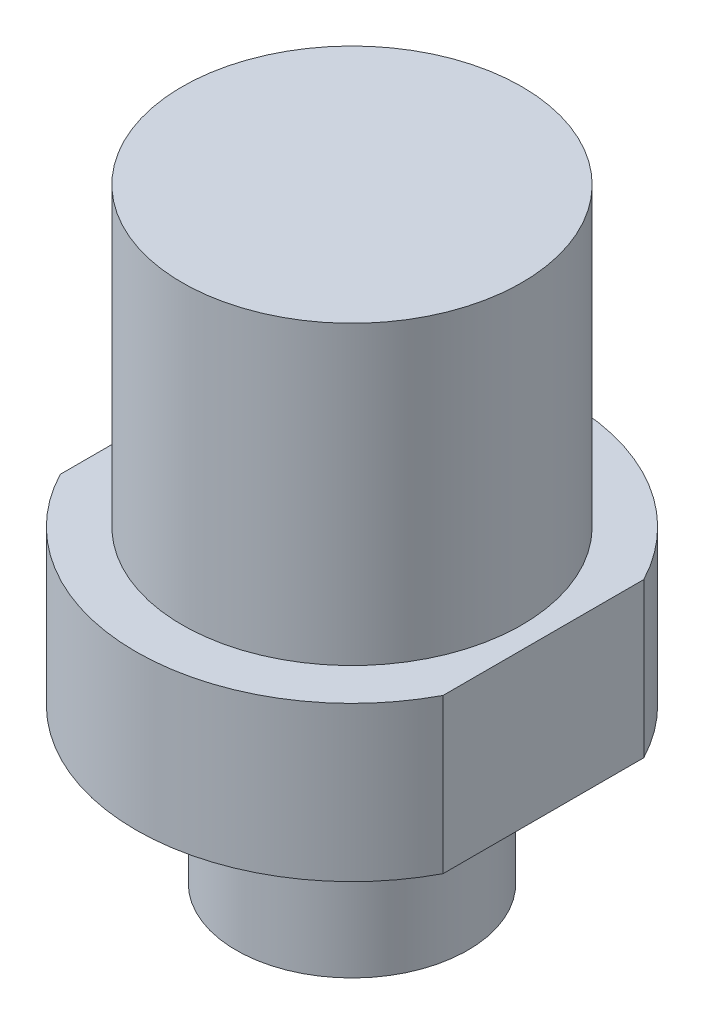
ISO-10303-21;
HEADER;
FILE_DESCRIPTION(('STEP AP214'),'2;1');
FILE_NAME('part.step','',(''),(''),'','','');
FILE_SCHEMA(('AUTOMOTIVE_DESIGN { 1 0 10303 214 1 1 1 1 }'));
ENDSEC;
DATA;
#1=APPLICATION_CONTEXT('core data for automotive mechanical design processes');
#2=APPLICATION_PROTOCOL_DEFINITION('international standard','automotive_design',2000,#1);
#3=PRODUCT_CONTEXT('',#1,'mechanical');
#4=PRODUCT('Part','Part','',(#3));
#5=PRODUCT_RELATED_PRODUCT_CATEGORY('part','',(#4));
#6=PRODUCT_DEFINITION_FORMATION('','',#4);
#7=PRODUCT_DEFINITION_CONTEXT('part definition',#1,'design');
#8=PRODUCT_DEFINITION('design','',#6,#7);
#9=PRODUCT_DEFINITION_SHAPE('','',#8);
#10=(LENGTH_UNIT() NAMED_UNIT(*) SI_UNIT(.MILLI.,.METRE.));
#11=(NAMED_UNIT(*) PLANE_ANGLE_UNIT() SI_UNIT($,.RADIAN.));
#12=(NAMED_UNIT(*) SI_UNIT($,.STERADIAN.) SOLID_ANGLE_UNIT());
#13=UNCERTAINTY_MEASURE_WITH_UNIT(LENGTH_MEASURE(1.E-05),#10,'distance_accuracy_value','');
#14=(GEOMETRIC_REPRESENTATION_CONTEXT(3) GLOBAL_UNCERTAINTY_ASSIGNED_CONTEXT((#13)) GLOBAL_UNIT_ASSIGNED_CONTEXT((#10,
#11,#12)) REPRESENTATION_CONTEXT('',''));
#15=CARTESIAN_POINT('',(0.,0.,0.));
#16=DIRECTION('',(0.,0.,1.));
#17=DIRECTION('',(1.,0.,0.));
#18=AXIS2_PLACEMENT_3D('',#15,#16,#17);
#19=CARTESIAN_POINT('',(0.,6.35,-6.985));
#20=DIRECTION('',(0.,1.,0.));
#21=DIRECTION('',(0.,0.,1.));
#22=AXIS2_PLACEMENT_3D('',#19,#20,#21);
#23=PLANE('',#22);
#24=CARTESIAN_POINT('',(0.,6.35,0.));
#25=DIRECTION('',(0.,-1.,0.));
#26=DIRECTION('',(0.,0.,-1.));
#27=AXIS2_PLACEMENT_3D('',#24,#25,#26);
#28=CIRCLE('',#27,6.985);
#29=CARTESIAN_POINT('',(0.,6.35,-6.985));
#30=VERTEX_POINT('',#29);
#31=EDGE_CURVE('E95',#30,#30,#28,.T.);
#32=ORIENTED_EDGE('',*,*,#31,.T.);
#33=EDGE_LOOP('',(#32));
#34=FACE_BOUND('',#33,.T.);
#35=CARTESIAN_POINT('',(0.,6.35,0.));
#36=DIRECTION('',(0.,-1.,0.));
#37=DIRECTION('',(0.,0.,-1.));
#38=AXIS2_PLACEMENT_3D('',#35,#36,#37);
#39=CIRCLE('',#38,8.89);
#40=CARTESIAN_POINT('',(-7.874,6.35,-4.12701150955506));
#41=VERTEX_POINT('',#40);
#42=CARTESIAN_POINT('',(7.874,6.35,-4.12701150955506));
#43=VERTEX_POINT('',#42);
#44=EDGE_CURVE('E96',#41,#43,#39,.T.);
#45=ORIENTED_EDGE('',*,*,#44,.F.);
#46=DIRECTION('',(0.,0.,1.));
#47=VECTOR('',#46,1.);
#48=CARTESIAN_POINT('',(-7.874,6.35,-6.985));
#49=LINE('',#48,#47);
#50=CARTESIAN_POINT('',(-7.874,6.35,4.12701150955507));
#51=VERTEX_POINT('',#50);
#52=EDGE_CURVE('E82',#41,#51,#49,.T.);
#53=ORIENTED_EDGE('',*,*,#52,.T.);
#54=CARTESIAN_POINT('',(7.874,6.35,4.12701150955507));
#55=VERTEX_POINT('',#54);
#56=EDGE_CURVE('E90',#55,#51,#39,.T.);
#57=ORIENTED_EDGE('',*,*,#56,.F.);
#58=DIRECTION('',(0.,0.,1.));
#59=VECTOR('',#58,1.);
#60=CARTESIAN_POINT('',(7.874,6.35,-6.985));
#61=LINE('',#60,#59);
#62=EDGE_CURVE('E74',#43,#55,#61,.T.);
#63=ORIENTED_EDGE('',*,*,#62,.F.);
#64=EDGE_LOOP('',(#45,#53,#57,#63));
#65=FACE_BOUND('',#64,.T.);
#66=ADVANCED_FACE('F36',(#34,#65),#23,.T.);
#67=CARTESIAN_POINT('',(0.,0.,0.));
#68=DIRECTION('',(0.,-1.,0.));
#69=DIRECTION('',(0.,0.,-1.));
#70=AXIS2_PLACEMENT_3D('',#67,#68,#69);
#71=CYLINDRICAL_SURFACE('',#70,8.89);
#72=CARTESIAN_POINT('',(0.,0.,0.));
#73=DIRECTION('',(0.,-1.,0.));
#74=DIRECTION('',(0.,0.,-1.));
#75=AXIS2_PLACEMENT_3D('',#72,#73,#74);
#76=CIRCLE('',#75,8.89);
#77=CARTESIAN_POINT('',(-7.874,0.,-4.12701150955506));
#78=VERTEX_POINT('',#77);
#79=CARTESIAN_POINT('',(7.874,0.,-4.12701150955506));
#80=VERTEX_POINT('',#79);
#81=EDGE_CURVE('E102',#78,#80,#76,.T.);
#82=ORIENTED_EDGE('',*,*,#81,.F.);
#83=DIRECTION('',(0.,1.,0.));
#84=VECTOR('',#83,1.);
#85=CARTESIAN_POINT('',(-7.874,-6.35,-4.12701150955506));
#86=LINE('',#85,#84);
#87=EDGE_CURVE('E51',#78,#41,#86,.T.);
#88=ORIENTED_EDGE('',*,*,#87,.T.);
#89=ORIENTED_EDGE('',*,*,#44,.T.);
#90=DIRECTION('',(0.,1.,0.));
#91=VECTOR('',#90,1.);
#92=CARTESIAN_POINT('',(7.874,-6.35,-4.12701150955506));
#93=LINE('',#92,#91);
#94=EDGE_CURVE('E77',#80,#43,#93,.T.);
#95=ORIENTED_EDGE('',*,*,#94,.F.);
#96=EDGE_LOOP('',(#82,#88,#89,#95));
#97=FACE_BOUND('',#96,.T.);
#98=ADVANCED_FACE('F110',(#97),#71,.T.);
#99=ORIENTED_EDGE('',*,*,#56,.T.);
#100=DIRECTION('',(0.,1.,0.));
#101=VECTOR('',#100,1.);
#102=CARTESIAN_POINT('',(-7.874,-6.35,4.12701150955507));
#103=LINE('',#102,#101);
#104=CARTESIAN_POINT('',(-7.874,0.,4.12701150955507));
#105=VERTEX_POINT('',#104);
#106=EDGE_CURVE('E83',#105,#51,#103,.T.);
#107=ORIENTED_EDGE('',*,*,#106,.F.);
#108=CARTESIAN_POINT('',(7.874,0.,4.12701150955506));
#109=VERTEX_POINT('',#108);
#110=EDGE_CURVE('E92',#109,#105,#76,.T.);
#111=ORIENTED_EDGE('',*,*,#110,.F.);
#112=DIRECTION('',(0.,1.,0.));
#113=VECTOR('',#112,1.);
#114=CARTESIAN_POINT('',(7.874,-6.35,4.12701150955507));
#115=LINE('',#114,#113);
#116=EDGE_CURVE('E58',#109,#55,#115,.T.);
#117=ORIENTED_EDGE('',*,*,#116,.T.);
#118=EDGE_LOOP('',(#99,#107,#111,#117));
#119=FACE_BOUND('',#118,.T.);
#120=ADVANCED_FACE('F88',(#119),#71,.T.);
#121=CARTESIAN_POINT('',(0.,0.,-8.89));
#122=DIRECTION('',(0.,-1.,0.));
#123=DIRECTION('',(0.,0.,-1.));
#124=AXIS2_PLACEMENT_3D('',#121,#122,#123);
#125=PLANE('',#124);
#126=CARTESIAN_POINT('',(0.,0.,0.));
#127=DIRECTION('',(0.,-1.,0.));
#128=DIRECTION('',(0.,0.,-1.));
#129=AXIS2_PLACEMENT_3D('',#126,#127,#128);
#130=CIRCLE('',#129,4.7625);
#131=CARTESIAN_POINT('',(0.,0.,-4.7625));
#132=VERTEX_POINT('',#131);
#133=EDGE_CURVE('E113',#132,#132,#130,.T.);
#134=ORIENTED_EDGE('',*,*,#133,.F.);
#135=EDGE_LOOP('',(#134));
#136=FACE_BOUND('',#135,.T.);
#137=ORIENTED_EDGE('',*,*,#110,.T.);
#138=DIRECTION('',(0.,0.,-1.));
#139=VECTOR('',#138,1.);
#140=CARTESIAN_POINT('',(-7.874,0.,-8.89));
#141=LINE('',#140,#139);
#142=EDGE_CURVE('E11',#105,#78,#141,.T.);
#143=ORIENTED_EDGE('',*,*,#142,.T.);
#144=ORIENTED_EDGE('',*,*,#81,.T.);
#145=DIRECTION('',(0.,0.,-1.));
#146=VECTOR('',#145,1.);
#147=CARTESIAN_POINT('',(7.874,0.,-8.89));
#148=LINE('',#147,#146);
#149=EDGE_CURVE('E44',#109,#80,#148,.T.);
#150=ORIENTED_EDGE('',*,*,#149,.F.);
#151=EDGE_LOOP('',(#137,#143,#144,#150));
#152=FACE_BOUND('',#151,.T.);
#153=ADVANCED_FACE('F112',(#136,#152),#125,.T.);
#154=CARTESIAN_POINT('',(0.,-6.35,-4.7625));
#155=DIRECTION('',(0.,-1.,0.));
#156=DIRECTION('',(0.,0.,-1.));
#157=AXIS2_PLACEMENT_3D('',#154,#155,#156);
#158=PLANE('',#157);
#159=CARTESIAN_POINT('',(0.,-6.35,0.));
#160=DIRECTION('',(0.,-1.,0.));
#161=DIRECTION('',(0.,0.,-1.));
#162=AXIS2_PLACEMENT_3D('',#159,#160,#161);
#163=CIRCLE('',#162,4.7625);
#164=CARTESIAN_POINT('',(0.,-6.35,-4.7625));
#165=VERTEX_POINT('',#164);
#166=EDGE_CURVE('E115',#165,#165,#163,.T.);
#167=ORIENTED_EDGE('',*,*,#166,.T.);
#168=EDGE_LOOP('',(#167));
#169=FACE_BOUND('',#168,.T.);
#170=ADVANCED_FACE('F38',(#169),#158,.T.);
#171=CARTESIAN_POINT('',(0.,18.542,0.));
#172=DIRECTION('',(0.,1.,0.));
#173=DIRECTION('',(0.,0.,1.));
#174=AXIS2_PLACEMENT_3D('',#171,#172,#173);
#175=PLANE('',#174);
#176=CARTESIAN_POINT('',(0.,18.542,0.));
#177=DIRECTION('',(0.,-1.,0.));
#178=DIRECTION('',(0.,0.,-1.));
#179=AXIS2_PLACEMENT_3D('',#176,#177,#178);
#180=CIRCLE('',#179,6.985);
#181=CARTESIAN_POINT('',(0.,18.542,-6.985));
#182=VERTEX_POINT('',#181);
#183=EDGE_CURVE('E99',#182,#182,#180,.T.);
#184=ORIENTED_EDGE('',*,*,#183,.F.);
#185=EDGE_LOOP('',(#184));
#186=FACE_BOUND('',#185,.T.);
#187=ADVANCED_FACE('F142',(#186),#175,.T.);
#188=CARTESIAN_POINT('',(0.,0.,0.));
#189=DIRECTION('',(0.,-1.,0.));
#190=DIRECTION('',(0.,0.,-1.));
#191=AXIS2_PLACEMENT_3D('',#188,#189,#190);
#192=CYLINDRICAL_SURFACE('',#191,6.985);
#193=ORIENTED_EDGE('',*,*,#183,.T.);
#194=EDGE_LOOP('',(#193));
#195=FACE_BOUND('',#194,.T.);
#196=ORIENTED_EDGE('',*,*,#31,.F.);
#197=EDGE_LOOP('',(#196));
#198=FACE_BOUND('',#197,.T.);
#199=ADVANCED_FACE('F140',(#195,#198),#192,.T.);
#200=CARTESIAN_POINT('',(0.,0.,0.));
#201=DIRECTION('',(0.,-1.,0.));
#202=DIRECTION('',(0.,0.,-1.));
#203=AXIS2_PLACEMENT_3D('',#200,#201,#202);
#204=CYLINDRICAL_SURFACE('',#203,4.7625);
#205=ORIENTED_EDGE('',*,*,#133,.T.);
#206=EDGE_LOOP('',(#205));
#207=FACE_BOUND('',#206,.T.);
#208=ORIENTED_EDGE('',*,*,#166,.F.);
#209=EDGE_LOOP('',(#208));
#210=FACE_BOUND('',#209,.T.);
#211=ADVANCED_FACE('F129',(#207,#210),#204,.T.);
#212=CARTESIAN_POINT('',(7.874,-6.35,0.));
#213=DIRECTION('',(-1.,0.,0.));
#214=DIRECTION('',(0.,0.,1.));
#215=AXIS2_PLACEMENT_3D('',#212,#213,#214);
#216=PLANE('',#215);
#217=ORIENTED_EDGE('',*,*,#62,.T.);
#218=ORIENTED_EDGE('',*,*,#116,.F.);
#219=ORIENTED_EDGE('',*,*,#149,.T.);
#220=ORIENTED_EDGE('',*,*,#94,.T.);
#221=EDGE_LOOP('',(#217,#218,#219,#220));
#222=FACE_BOUND('',#221,.T.);
#223=ADVANCED_FACE('F75',(#222),#216,.F.);
#224=CARTESIAN_POINT('',(-7.874,-6.35,0.));
#225=DIRECTION('',(-1.,0.,0.));
#226=DIRECTION('',(0.,0.,1.));
#227=AXIS2_PLACEMENT_3D('',#224,#225,#226);
#228=PLANE('',#227);
#229=ORIENTED_EDGE('',*,*,#87,.F.);
#230=ORIENTED_EDGE('',*,*,#142,.F.);
#231=ORIENTED_EDGE('',*,*,#106,.T.);
#232=ORIENTED_EDGE('',*,*,#52,.F.);
#233=EDGE_LOOP('',(#229,#230,#231,#232));
#234=FACE_BOUND('',#233,.T.);
#235=ADVANCED_FACE('F123',(#234),#228,.T.);
#236=CLOSED_SHELL('',(#66,#98,#120,#153,#170,#187,#199,#211,#223,#235));
#237=MANIFOLD_SOLID_BREP('B2',#236);
#238=ADVANCED_BREP_SHAPE_REPRESENTATION('',(#18,#237),#14);
#239=SHAPE_DEFINITION_REPRESENTATION(#9,#238);
ENDSEC;
END-ISO-10303-21;
